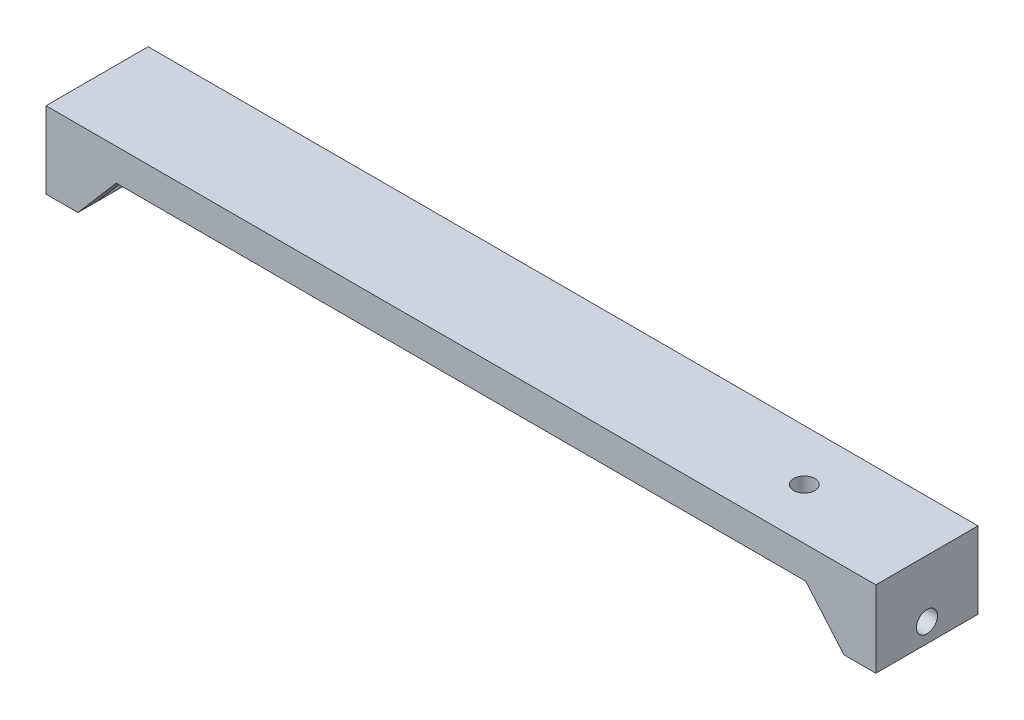
ISO-10303-21;
HEADER;
FILE_DESCRIPTION(('STEP AP214'),'2;1');
FILE_NAME('part.step','',(''),(''),'','','');
FILE_SCHEMA(('AUTOMOTIVE_DESIGN { 1 0 10303 214 1 1 1 1 }'));
ENDSEC;
DATA;
#1=APPLICATION_CONTEXT('core data for automotive mechanical design processes');
#2=APPLICATION_PROTOCOL_DEFINITION('international standard','automotive_design',2000,#1);
#3=PRODUCT_CONTEXT('',#1,'mechanical');
#4=PRODUCT('Part','Part','',(#3));
#5=PRODUCT_RELATED_PRODUCT_CATEGORY('part','',(#4));
#6=PRODUCT_DEFINITION_FORMATION('','',#4);
#7=PRODUCT_DEFINITION_CONTEXT('part definition',#1,'design');
#8=PRODUCT_DEFINITION('design','',#6,#7);
#9=PRODUCT_DEFINITION_SHAPE('','',#8);
#10=(LENGTH_UNIT() NAMED_UNIT(*) SI_UNIT(.MILLI.,.METRE.));
#11=(NAMED_UNIT(*) PLANE_ANGLE_UNIT() SI_UNIT($,.RADIAN.));
#12=(NAMED_UNIT(*) SI_UNIT($,.STERADIAN.) SOLID_ANGLE_UNIT());
#13=UNCERTAINTY_MEASURE_WITH_UNIT(LENGTH_MEASURE(1.E-05),#10,'distance_accuracy_value','');
#14=(GEOMETRIC_REPRESENTATION_CONTEXT(3) GLOBAL_UNCERTAINTY_ASSIGNED_CONTEXT((#13)) GLOBAL_UNIT_ASSIGNED_CONTEXT((#10,
#11,#12)) REPRESENTATION_CONTEXT('',''));
#15=CARTESIAN_POINT('',(0.,0.,0.));
#16=DIRECTION('',(0.,0.,1.));
#17=DIRECTION('',(1.,0.,0.));
#18=AXIS2_PLACEMENT_3D('',#15,#16,#17);
#19=CARTESIAN_POINT('',(60.,-5.00000000000001,16.));
#20=DIRECTION('',(0.,1.,0.));
#21=DIRECTION('',(0.,0.,1.));
#22=AXIS2_PLACEMENT_3D('',#19,#20,#21);
#23=PLANE('',#22);
#24=CARTESIAN_POINT('',(45.79,-5.00000000000001,8.));
#25=DIRECTION('',(0.,1.,0.));
#26=DIRECTION('',(0.,0.,1.));
#27=AXIS2_PLACEMENT_3D('',#24,#25,#26);
#28=CIRCLE('',#27,1.65);
#29=CARTESIAN_POINT('',(45.79,-5.00000000000001,9.65));
#30=VERTEX_POINT('',#29);
#31=EDGE_CURVE('E158',#30,#30,#28,.T.);
#32=ORIENTED_EDGE('',*,*,#31,.T.);
#33=EDGE_LOOP('',(#32));
#34=FACE_BOUND('',#33,.T.);
#35=DIRECTION('',(-1.,0.,0.));
#36=VECTOR('',#35,1.);
#37=CARTESIAN_POINT('',(54.,-5.00000000000001,13.));
#38=LINE('',#37,#36);
#39=CARTESIAN_POINT('',(60.,-5.00000000000001,13.));
#40=VERTEX_POINT('',#39);
#41=CARTESIAN_POINT('',(54.,-5.00000000000001,13.));
#42=VERTEX_POINT('',#41);
#43=EDGE_CURVE('E154',#40,#42,#38,.T.);
#44=ORIENTED_EDGE('',*,*,#43,.T.);
#45=DIRECTION('',(0.,0.,1.));
#46=VECTOR('',#45,1.);
#47=CARTESIAN_POINT('',(54.,-5.00000000000001,13.));
#48=LINE('',#47,#46);
#49=CARTESIAN_POINT('',(54.,-5.00000000000001,16.));
#50=VERTEX_POINT('',#49);
#51=EDGE_CURVE('E139',#42,#50,#48,.T.);
#52=ORIENTED_EDGE('',*,*,#51,.T.);
#53=DIRECTION('',(1.,0.,0.));
#54=VECTOR('',#53,1.);
#55=CARTESIAN_POINT('',(60.,-5.00000000000001,16.));
#56=LINE('',#55,#54);
#57=CARTESIAN_POINT('',(-54.,-5.00000000000001,16.));
#58=VERTEX_POINT('',#57);
#59=EDGE_CURVE('E227',#58,#50,#56,.T.);
#60=ORIENTED_EDGE('',*,*,#59,.F.);
#61=DIRECTION('',(0.,0.,1.));
#62=VECTOR('',#61,1.);
#63=CARTESIAN_POINT('',(-54.,-5.00000000000001,13.));
#64=LINE('',#63,#62);
#65=CARTESIAN_POINT('',(-54.,-5.00000000000001,13.));
#66=VERTEX_POINT('',#65);
#67=EDGE_CURVE('E187',#66,#58,#64,.T.);
#68=ORIENTED_EDGE('',*,*,#67,.F.);
#69=DIRECTION('',(1.,0.,0.));
#70=VECTOR('',#69,1.);
#71=CARTESIAN_POINT('',(-54.,-5.00000000000001,13.));
#72=LINE('',#71,#70);
#73=CARTESIAN_POINT('',(-60.,-5.00000000000001,13.));
#74=VERTEX_POINT('',#73);
#75=EDGE_CURVE('E180',#74,#66,#72,.T.);
#76=ORIENTED_EDGE('',*,*,#75,.F.);
#77=DIRECTION('',(0.,0.,-1.));
#78=VECTOR('',#77,1.);
#79=CARTESIAN_POINT('',(-60.,-5.00000000000001,16.));
#80=LINE('',#79,#78);
#81=CARTESIAN_POINT('',(-60.,-5.00000000000001,3.));
#82=VERTEX_POINT('',#81);
#83=EDGE_CURVE('E260',#74,#82,#80,.T.);
#84=ORIENTED_EDGE('',*,*,#83,.T.);
#85=DIRECTION('',(1.,0.,0.));
#86=VECTOR('',#85,1.);
#87=CARTESIAN_POINT('',(-54.,-5.00000000000001,3.));
#88=LINE('',#87,#86);
#89=CARTESIAN_POINT('',(-54.,-5.00000000000001,3.));
#90=VERTEX_POINT('',#89);
#91=EDGE_CURVE('E192',#82,#90,#88,.T.);
#92=ORIENTED_EDGE('',*,*,#91,.T.);
#93=DIRECTION('',(0.,0.,-1.));
#94=VECTOR('',#93,1.);
#95=CARTESIAN_POINT('',(-54.,-5.00000000000001,3.));
#96=LINE('',#95,#94);
#97=CARTESIAN_POINT('',(-54.,-5.,0.));
#98=VERTEX_POINT('',#97);
#99=EDGE_CURVE('E200',#90,#98,#96,.T.);
#100=ORIENTED_EDGE('',*,*,#99,.T.);
#101=DIRECTION('',(1.,0.,0.));
#102=VECTOR('',#101,1.);
#103=CARTESIAN_POINT('',(60.,-5.00000000000001,0.));
#104=LINE('',#103,#102);
#105=CARTESIAN_POINT('',(54.,-5.00000000000002,0.));
#106=VERTEX_POINT('',#105);
#107=EDGE_CURVE('E240',#98,#106,#104,.T.);
#108=ORIENTED_EDGE('',*,*,#107,.T.);
#109=DIRECTION('',(0.,0.,-1.));
#110=VECTOR('',#109,1.);
#111=CARTESIAN_POINT('',(54.,-5.00000000000001,3.));
#112=LINE('',#111,#110);
#113=CARTESIAN_POINT('',(54.,-5.00000000000001,3.));
#114=VERTEX_POINT('',#113);
#115=EDGE_CURVE('E52',#114,#106,#112,.T.);
#116=ORIENTED_EDGE('',*,*,#115,.F.);
#117=DIRECTION('',(-1.,0.,0.));
#118=VECTOR('',#117,1.);
#119=CARTESIAN_POINT('',(54.,-5.00000000000001,3.));
#120=LINE('',#119,#118);
#121=CARTESIAN_POINT('',(60.,-5.00000000000001,3.));
#122=VERTEX_POINT('',#121);
#123=EDGE_CURVE('E164',#122,#114,#120,.T.);
#124=ORIENTED_EDGE('',*,*,#123,.F.);
#125=DIRECTION('',(0.,0.,-1.));
#126=VECTOR('',#125,1.);
#127=CARTESIAN_POINT('',(60.,-5.00000000000001,16.));
#128=LINE('',#127,#126);
#129=EDGE_CURVE('E60',#40,#122,#128,.T.);
#130=ORIENTED_EDGE('',*,*,#129,.F.);
#131=EDGE_LOOP('',(#44,#52,#60,#68,#76,#84,#92,#100,#108,#116,#124,#130));
#132=FACE_BOUND('',#131,.T.);
#133=ADVANCED_FACE('F37',(#34,#132),#23,.F.);
#134=CARTESIAN_POINT('',(-65.,-12.,16.));
#135=DIRECTION('',(1.,0.,0.));
#136=DIRECTION('',(0.,0.,-1.));
#137=AXIS2_PLACEMENT_3D('',#134,#135,#136);
#138=PLANE('',#137);
#139=CARTESIAN_POINT('',(-65.,-8.99999999999993,8.));
#140=DIRECTION('',(1.,0.,0.));
#141=DIRECTION('',(0.,1.,0.));
#142=AXIS2_PLACEMENT_3D('',#139,#140,#141);
#143=CIRCLE('',#142,1.65);
#144=CARTESIAN_POINT('',(-65.,-7.34999999999993,8.));
#145=VERTEX_POINT('',#144);
#146=EDGE_CURVE('E210',#145,#145,#143,.T.);
#147=ORIENTED_EDGE('',*,*,#146,.T.);
#148=EDGE_LOOP('',(#147));
#149=FACE_BOUND('',#148,.T.);
#150=DIRECTION('',(0.,-1.,0.));
#151=VECTOR('',#150,1.);
#152=CARTESIAN_POINT('',(-65.,-12.,0.));
#153=LINE('',#152,#151);
#154=CARTESIAN_POINT('',(-65.,0.,0.));
#155=VERTEX_POINT('',#154);
#156=CARTESIAN_POINT('',(-65.,-12.,0.));
#157=VERTEX_POINT('',#156);
#158=EDGE_CURVE('E219',#155,#157,#153,.T.);
#159=ORIENTED_EDGE('',*,*,#158,.T.);
#160=DIRECTION('',(0.,0.,-1.));
#161=VECTOR('',#160,1.);
#162=CARTESIAN_POINT('',(-65.,-12.,16.));
#163=LINE('',#162,#161);
#164=CARTESIAN_POINT('',(-65.,-12.,16.));
#165=VERTEX_POINT('',#164);
#166=EDGE_CURVE('E11',#165,#157,#163,.T.);
#167=ORIENTED_EDGE('',*,*,#166,.F.);
#168=DIRECTION('',(0.,-1.,0.));
#169=VECTOR('',#168,1.);
#170=CARTESIAN_POINT('',(-65.,-12.,16.));
#171=LINE('',#170,#169);
#172=CARTESIAN_POINT('',(-65.,0.,16.));
#173=VERTEX_POINT('',#172);
#174=EDGE_CURVE('E220',#173,#165,#171,.T.);
#175=ORIENTED_EDGE('',*,*,#174,.F.);
#176=DIRECTION('',(0.,0.,-1.));
#177=VECTOR('',#176,1.);
#178=CARTESIAN_POINT('',(-65.,0.,16.));
#179=LINE('',#178,#177);
#180=EDGE_CURVE('E235',#173,#155,#179,.T.);
#181=ORIENTED_EDGE('',*,*,#180,.T.);
#182=EDGE_LOOP('',(#159,#167,#175,#181));
#183=FACE_BOUND('',#182,.T.);
#184=ADVANCED_FACE('F39',(#149,#183),#138,.F.);
#185=CARTESIAN_POINT('',(-60.,-12.,16.));
#186=DIRECTION('',(0.,1.,0.));
#187=DIRECTION('',(-1.,0.,0.));
#188=AXIS2_PLACEMENT_3D('',#185,#186,#187);
#189=PLANE('',#188);
#190=DIRECTION('',(1.,0.,0.));
#191=VECTOR('',#190,1.);
#192=CARTESIAN_POINT('',(-60.,-12.,0.));
#193=LINE('',#192,#191);
#194=CARTESIAN_POINT('',(-60.,-12.,0.));
#195=VERTEX_POINT('',#194);
#196=EDGE_CURVE('E238',#157,#195,#193,.T.);
#197=ORIENTED_EDGE('',*,*,#196,.T.);
#198=DIRECTION('',(0.,0.,-1.));
#199=VECTOR('',#198,1.);
#200=CARTESIAN_POINT('',(-60.,-12.,3.));
#201=LINE('',#200,#199);
#202=CARTESIAN_POINT('',(-60.,-12.,3.));
#203=VERTEX_POINT('',#202);
#204=EDGE_CURVE('E203',#203,#195,#201,.T.);
#205=ORIENTED_EDGE('',*,*,#204,.F.);
#206=DIRECTION('',(0.,0.,-1.));
#207=VECTOR('',#206,1.);
#208=CARTESIAN_POINT('',(-60.,-12.,16.));
#209=LINE('',#208,#207);
#210=CARTESIAN_POINT('',(-60.,-12.,13.));
#211=VERTEX_POINT('',#210);
#212=EDGE_CURVE('E261',#211,#203,#209,.T.);
#213=ORIENTED_EDGE('',*,*,#212,.F.);
#214=CARTESIAN_POINT('',(-60.,-12.,16.));
#215=VERTEX_POINT('',#214);
#216=EDGE_CURVE('E45',#215,#211,#209,.T.);
#217=ORIENTED_EDGE('',*,*,#216,.F.);
#218=DIRECTION('',(1.,0.,0.));
#219=VECTOR('',#218,1.);
#220=CARTESIAN_POINT('',(-60.,-12.,16.));
#221=LINE('',#220,#219);
#222=EDGE_CURVE('E223',#165,#215,#221,.T.);
#223=ORIENTED_EDGE('',*,*,#222,.F.);
#224=ORIENTED_EDGE('',*,*,#166,.T.);
#225=EDGE_LOOP('',(#197,#205,#213,#217,#223,#224));
#226=FACE_BOUND('',#225,.T.);
#227=ADVANCED_FACE('F274',(#226),#189,.F.);
#228=CARTESIAN_POINT('',(-60.,-5.00000000000001,16.));
#229=DIRECTION('',(-1.,0.,0.));
#230=DIRECTION('',(0.,-1.,0.));
#231=AXIS2_PLACEMENT_3D('',#228,#229,#230);
#232=PLANE('',#231);
#233=CARTESIAN_POINT('',(-60.,-8.99999999999994,8.));
#234=DIRECTION('',(-1.,0.,0.));
#235=DIRECTION('',(0.,-1.,0.));
#236=AXIS2_PLACEMENT_3D('',#233,#234,#235);
#237=CIRCLE('',#236,1.65);
#238=CARTESIAN_POINT('',(-60.,-10.6499999999999,8.));
#239=VERTEX_POINT('',#238);
#240=EDGE_CURVE('E216',#239,#239,#237,.T.);
#241=ORIENTED_EDGE('',*,*,#240,.T.);
#242=EDGE_LOOP('',(#241));
#243=FACE_BOUND('',#242,.T.);
#244=ORIENTED_EDGE('',*,*,#83,.F.);
#245=DIRECTION('',(0.,1.,0.));
#246=VECTOR('',#245,1.);
#247=CARTESIAN_POINT('',(-60.,-5.00000000000001,13.));
#248=LINE('',#247,#246);
#249=EDGE_CURVE('E183',#211,#74,#248,.T.);
#250=ORIENTED_EDGE('',*,*,#249,.F.);
#251=ORIENTED_EDGE('',*,*,#212,.T.);
#252=DIRECTION('',(0.,1.,0.));
#253=VECTOR('',#252,1.);
#254=CARTESIAN_POINT('',(-60.,-5.00000000000001,3.));
#255=LINE('',#254,#253);
#256=EDGE_CURVE('E197',#203,#82,#255,.T.);
#257=ORIENTED_EDGE('',*,*,#256,.T.);
#258=EDGE_LOOP('',(#244,#250,#251,#257));
#259=FACE_BOUND('',#258,.T.);
#260=ADVANCED_FACE('F270',(#243,#259),#232,.F.);
#261=CARTESIAN_POINT('',(60.,-12.,16.));
#262=DIRECTION('',(1.,0.,0.));
#263=DIRECTION('',(0.,1.,0.));
#264=AXIS2_PLACEMENT_3D('',#261,#262,#263);
#265=PLANE('',#264);
#266=CARTESIAN_POINT('',(60.,-9.00000000000001,8.));
#267=DIRECTION('',(1.,0.,0.));
#268=DIRECTION('',(0.,1.,0.));
#269=AXIS2_PLACEMENT_3D('',#266,#267,#268);
#270=CIRCLE('',#269,1.65);
#271=CARTESIAN_POINT('',(60.,-7.35000000000001,8.));
#272=VERTEX_POINT('',#271);
#273=EDGE_CURVE('E213',#272,#272,#270,.T.);
#274=ORIENTED_EDGE('',*,*,#273,.T.);
#275=EDGE_LOOP('',(#274));
#276=FACE_BOUND('',#275,.T.);
#277=DIRECTION('',(0.,0.,-1.));
#278=VECTOR('',#277,1.);
#279=CARTESIAN_POINT('',(60.,-12.,16.));
#280=LINE('',#279,#278);
#281=CARTESIAN_POINT('',(60.,-12.,13.));
#282=VERTEX_POINT('',#281);
#283=CARTESIAN_POINT('',(60.,-12.,3.));
#284=VERTEX_POINT('',#283);
#285=EDGE_CURVE('E255',#282,#284,#280,.T.);
#286=ORIENTED_EDGE('',*,*,#285,.F.);
#287=DIRECTION('',(0.,1.,0.));
#288=VECTOR('',#287,1.);
#289=CARTESIAN_POINT('',(60.,-5.00000000000001,13.));
#290=LINE('',#289,#288);
#291=EDGE_CURVE('E150',#282,#40,#290,.T.);
#292=ORIENTED_EDGE('',*,*,#291,.T.);
#293=ORIENTED_EDGE('',*,*,#129,.T.);
#294=DIRECTION('',(0.,1.,0.));
#295=VECTOR('',#294,1.);
#296=CARTESIAN_POINT('',(60.,-5.00000000000001,3.));
#297=LINE('',#296,#295);
#298=EDGE_CURVE('E167',#284,#122,#297,.T.);
#299=ORIENTED_EDGE('',*,*,#298,.F.);
#300=EDGE_LOOP('',(#286,#292,#293,#299));
#301=FACE_BOUND('',#300,.T.);
#302=ADVANCED_FACE('F305',(#276,#301),#265,.F.);
#303=CARTESIAN_POINT('',(65.,-12.,16.));
#304=DIRECTION('',(0.,1.,0.));
#305=DIRECTION('',(-1.,0.,0.));
#306=AXIS2_PLACEMENT_3D('',#303,#304,#305);
#307=PLANE('',#306);
#308=DIRECTION('',(1.,0.,0.));
#309=VECTOR('',#308,1.);
#310=CARTESIAN_POINT('',(65.,-12.,0.));
#311=LINE('',#310,#309);
#312=CARTESIAN_POINT('',(60.,-12.,0.));
#313=VERTEX_POINT('',#312);
#314=CARTESIAN_POINT('',(65.,-12.,0.));
#315=VERTEX_POINT('',#314);
#316=EDGE_CURVE('E242',#313,#315,#311,.T.);
#317=ORIENTED_EDGE('',*,*,#316,.T.);
#318=DIRECTION('',(0.,0.,-1.));
#319=VECTOR('',#318,1.);
#320=CARTESIAN_POINT('',(65.,-12.,16.));
#321=LINE('',#320,#319);
#322=CARTESIAN_POINT('',(65.,-12.,16.));
#323=VERTEX_POINT('',#322);
#324=EDGE_CURVE('E252',#323,#315,#321,.T.);
#325=ORIENTED_EDGE('',*,*,#324,.F.);
#326=DIRECTION('',(1.,0.,0.));
#327=VECTOR('',#326,1.);
#328=CARTESIAN_POINT('',(65.,-12.,16.));
#329=LINE('',#328,#327);
#330=CARTESIAN_POINT('',(60.,-12.,16.));
#331=VERTEX_POINT('',#330);
#332=EDGE_CURVE('E229',#331,#323,#329,.T.);
#333=ORIENTED_EDGE('',*,*,#332,.F.);
#334=EDGE_CURVE('E256',#331,#282,#280,.T.);
#335=ORIENTED_EDGE('',*,*,#334,.T.);
#336=ORIENTED_EDGE('',*,*,#285,.T.);
#337=DIRECTION('',(0.,0.,-1.));
#338=VECTOR('',#337,1.);
#339=CARTESIAN_POINT('',(60.,-12.,3.));
#340=LINE('',#339,#338);
#341=EDGE_CURVE('E173',#284,#313,#340,.T.);
#342=ORIENTED_EDGE('',*,*,#341,.T.);
#343=EDGE_LOOP('',(#317,#325,#333,#335,#336,#342));
#344=FACE_BOUND('',#343,.T.);
#345=ADVANCED_FACE('F308',(#344),#307,.F.);
#346=CARTESIAN_POINT('',(65.,0.,16.));
#347=DIRECTION('',(-1.,0.,0.));
#348=DIRECTION('',(0.,0.,1.));
#349=AXIS2_PLACEMENT_3D('',#346,#347,#348);
#350=PLANE('',#349);
#351=CARTESIAN_POINT('',(65.,-9.00000000000001,8.));
#352=DIRECTION('',(1.,0.,0.));
#353=DIRECTION('',(0.,1.,0.));
#354=AXIS2_PLACEMENT_3D('',#351,#352,#353);
#355=CIRCLE('',#354,1.65);
#356=CARTESIAN_POINT('',(65.,-7.35000000000001,8.));
#357=VERTEX_POINT('',#356);
#358=EDGE_CURVE('E206',#357,#357,#355,.T.);
#359=ORIENTED_EDGE('',*,*,#358,.F.);
#360=EDGE_LOOP('',(#359));
#361=FACE_BOUND('',#360,.T.);
#362=DIRECTION('',(0.,1.,0.));
#363=VECTOR('',#362,1.);
#364=CARTESIAN_POINT('',(65.,0.,0.));
#365=LINE('',#364,#363);
#366=CARTESIAN_POINT('',(65.,0.,0.));
#367=VERTEX_POINT('',#366);
#368=EDGE_CURVE('E244',#315,#367,#365,.T.);
#369=ORIENTED_EDGE('',*,*,#368,.T.);
#370=DIRECTION('',(0.,0.,-1.));
#371=VECTOR('',#370,1.);
#372=CARTESIAN_POINT('',(65.,0.,16.));
#373=LINE('',#372,#371);
#374=CARTESIAN_POINT('',(65.,0.,16.));
#375=VERTEX_POINT('',#374);
#376=EDGE_CURVE('E249',#375,#367,#373,.T.);
#377=ORIENTED_EDGE('',*,*,#376,.F.);
#378=DIRECTION('',(0.,1.,0.));
#379=VECTOR('',#378,1.);
#380=CARTESIAN_POINT('',(65.,0.,16.));
#381=LINE('',#380,#379);
#382=EDGE_CURVE('E231',#323,#375,#381,.T.);
#383=ORIENTED_EDGE('',*,*,#382,.F.);
#384=ORIENTED_EDGE('',*,*,#324,.T.);
#385=EDGE_LOOP('',(#369,#377,#383,#384));
#386=FACE_BOUND('',#385,.T.);
#387=ADVANCED_FACE('F314',(#361,#386),#350,.F.);
#388=CARTESIAN_POINT('',(-65.,0.,16.));
#389=DIRECTION('',(0.,-1.,0.));
#390=DIRECTION('',(0.,0.,-1.));
#391=AXIS2_PLACEMENT_3D('',#388,#389,#390);
#392=PLANE('',#391);
#393=CARTESIAN_POINT('',(45.79,0.,8.));
#394=DIRECTION('',(0.,1.,0.));
#395=DIRECTION('',(0.,0.,1.));
#396=AXIS2_PLACEMENT_3D('',#393,#394,#395);
#397=CIRCLE('',#396,1.65);
#398=CARTESIAN_POINT('',(45.79,0.,9.65));
#399=VERTEX_POINT('',#398);
#400=EDGE_CURVE('E500',#399,#399,#397,.T.);
#401=ORIENTED_EDGE('',*,*,#400,.F.);
#402=EDGE_LOOP('',(#401));
#403=FACE_BOUND('',#402,.T.);
#404=DIRECTION('',(-1.,0.,0.));
#405=VECTOR('',#404,1.);
#406=CARTESIAN_POINT('',(-65.,0.,0.));
#407=LINE('',#406,#405);
#408=EDGE_CURVE('E224',#367,#155,#407,.T.);
#409=ORIENTED_EDGE('',*,*,#408,.T.);
#410=ORIENTED_EDGE('',*,*,#180,.F.);
#411=DIRECTION('',(-1.,0.,0.));
#412=VECTOR('',#411,1.);
#413=CARTESIAN_POINT('',(-65.,0.,16.));
#414=LINE('',#413,#412);
#415=EDGE_CURVE('E233',#375,#173,#414,.T.);
#416=ORIENTED_EDGE('',*,*,#415,.F.);
#417=ORIENTED_EDGE('',*,*,#376,.T.);
#418=EDGE_LOOP('',(#409,#410,#416,#417));
#419=FACE_BOUND('',#418,.T.);
#420=ADVANCED_FACE('F316',(#403,#419),#392,.F.);
#421=CARTESIAN_POINT('',(0.,0.,16.));
#422=DIRECTION('',(0.,0.,-1.));
#423=DIRECTION('',(-1.,0.,0.));
#424=AXIS2_PLACEMENT_3D('',#421,#422,#423);
#425=PLANE('',#424);
#426=ORIENTED_EDGE('',*,*,#59,.T.);
#427=DIRECTION('',(0.65079137345597,-0.759256602365296,0.));
#428=VECTOR('',#427,1.);
#429=CARTESIAN_POINT('',(54.,-5.00000000000001,16.));
#430=LINE('',#429,#428);
#431=EDGE_CURVE('E145',#50,#331,#430,.T.);
#432=ORIENTED_EDGE('',*,*,#431,.T.);
#433=ORIENTED_EDGE('',*,*,#332,.T.);
#434=ORIENTED_EDGE('',*,*,#382,.T.);
#435=ORIENTED_EDGE('',*,*,#415,.T.);
#436=ORIENTED_EDGE('',*,*,#174,.T.);
#437=ORIENTED_EDGE('',*,*,#222,.T.);
#438=DIRECTION('',(-0.65079137345597,-0.759256602365296,0.));
#439=VECTOR('',#438,1.);
#440=CARTESIAN_POINT('',(-54.,-5.00000000000001,16.));
#441=LINE('',#440,#439);
#442=EDGE_CURVE('E177',#58,#215,#441,.T.);
#443=ORIENTED_EDGE('',*,*,#442,.F.);
#444=EDGE_LOOP('',(#426,#432,#433,#434,#435,#436,#437,#443));
#445=FACE_BOUND('',#444,.T.);
#446=ADVANCED_FACE('F289',(#445),#425,.F.);
#447=CARTESIAN_POINT('',(0.,0.,0.));
#448=DIRECTION('',(0.,0.,-1.));
#449=DIRECTION('',(-1.,0.,0.));
#450=AXIS2_PLACEMENT_3D('',#447,#448,#449);
#451=PLANE('',#450);
#452=DIRECTION('',(0.65079137345597,-0.759256602365296,0.));
#453=VECTOR('',#452,1.);
#454=CARTESIAN_POINT('',(54.,-5.00000000000001,0.));
#455=LINE('',#454,#453);
#456=EDGE_CURVE('E149',#106,#313,#455,.T.);
#457=ORIENTED_EDGE('',*,*,#456,.F.);
#458=ORIENTED_EDGE('',*,*,#107,.F.);
#459=DIRECTION('',(-0.65079137345597,-0.759256602365296,0.));
#460=VECTOR('',#459,1.);
#461=CARTESIAN_POINT('',(-54.,-5.00000000000001,0.));
#462=LINE('',#461,#460);
#463=EDGE_CURVE('E191',#98,#195,#462,.T.);
#464=ORIENTED_EDGE('',*,*,#463,.T.);
#465=ORIENTED_EDGE('',*,*,#196,.F.);
#466=ORIENTED_EDGE('',*,*,#158,.F.);
#467=ORIENTED_EDGE('',*,*,#408,.F.);
#468=ORIENTED_EDGE('',*,*,#368,.F.);
#469=ORIENTED_EDGE('',*,*,#316,.F.);
#470=EDGE_LOOP('',(#457,#458,#464,#465,#466,#467,#468,#469));
#471=FACE_BOUND('',#470,.T.);
#472=ADVANCED_FACE('F298',(#471),#451,.T.);
#473=CARTESIAN_POINT('',(-65.,-8.99999999999993,8.));
#474=DIRECTION('',(1.,0.,0.));
#475=DIRECTION('',(0.,1.,0.));
#476=AXIS2_PLACEMENT_3D('',#473,#474,#475);
#477=CYLINDRICAL_SURFACE('',#476,1.65);
#478=ORIENTED_EDGE('',*,*,#358,.T.);
#479=EDGE_LOOP('',(#478));
#480=FACE_BOUND('',#479,.T.);
#481=ORIENTED_EDGE('',*,*,#273,.F.);
#482=EDGE_LOOP('',(#481));
#483=FACE_BOUND('',#482,.T.);
#484=ADVANCED_FACE('F378',(#480,#483),#477,.F.);
#485=ORIENTED_EDGE('',*,*,#146,.F.);
#486=EDGE_LOOP('',(#485));
#487=FACE_BOUND('',#486,.T.);
#488=ORIENTED_EDGE('',*,*,#240,.F.);
#489=EDGE_LOOP('',(#488));
#490=FACE_BOUND('',#489,.T.);
#491=ADVANCED_FACE('F383',(#487,#490),#477,.F.);
#492=CARTESIAN_POINT('',(-54.,-5.00000000000001,3.));
#493=DIRECTION('',(0.759256602365296,-0.650791373455969,0.));
#494=DIRECTION('',(0.65079137345597,0.759256602365296,0.));
#495=AXIS2_PLACEMENT_3D('',#492,#493,#494);
#496=PLANE('',#495);
#497=ORIENTED_EDGE('',*,*,#463,.F.);
#498=ORIENTED_EDGE('',*,*,#99,.F.);
#499=DIRECTION('',(-0.65079137345597,-0.759256602365296,0.));
#500=VECTOR('',#499,1.);
#501=CARTESIAN_POINT('',(-54.,-5.00000000000001,3.));
#502=LINE('',#501,#500);
#503=EDGE_CURVE('E194',#90,#203,#502,.T.);
#504=ORIENTED_EDGE('',*,*,#503,.T.);
#505=ORIENTED_EDGE('',*,*,#204,.T.);
#506=EDGE_LOOP('',(#497,#498,#504,#505));
#507=FACE_BOUND('',#506,.T.);
#508=ADVANCED_FACE('F279',(#507),#496,.T.);
#509=CARTESIAN_POINT('',(0.,0.,3.));
#510=DIRECTION('',(0.,0.,1.));
#511=DIRECTION('',(1.,0.,0.));
#512=AXIS2_PLACEMENT_3D('',#509,#510,#511);
#513=PLANE('',#512);
#514=ORIENTED_EDGE('',*,*,#91,.F.);
#515=ORIENTED_EDGE('',*,*,#256,.F.);
#516=ORIENTED_EDGE('',*,*,#503,.F.);
#517=EDGE_LOOP('',(#514,#515,#516));
#518=FACE_BOUND('',#517,.T.);
#519=ADVANCED_FACE('F281',(#518),#513,.T.);
#520=CARTESIAN_POINT('',(-54.,-5.00000000000001,13.));
#521=DIRECTION('',(-0.759256602365296,0.650791373455969,0.));
#522=DIRECTION('',(-0.65079137345597,-0.759256602365296,0.));
#523=AXIS2_PLACEMENT_3D('',#520,#521,#522);
#524=PLANE('',#523);
#525=ORIENTED_EDGE('',*,*,#442,.T.);
#526=ORIENTED_EDGE('',*,*,#216,.T.);
#527=DIRECTION('',(-0.65079137345597,-0.759256602365296,0.));
#528=VECTOR('',#527,1.);
#529=CARTESIAN_POINT('',(-54.,-5.00000000000001,13.));
#530=LINE('',#529,#528);
#531=EDGE_CURVE('E185',#66,#211,#530,.T.);
#532=ORIENTED_EDGE('',*,*,#531,.F.);
#533=ORIENTED_EDGE('',*,*,#67,.T.);
#534=EDGE_LOOP('',(#525,#526,#532,#533));
#535=FACE_BOUND('',#534,.T.);
#536=ADVANCED_FACE('F287',(#535),#524,.F.);
#537=CARTESIAN_POINT('',(0.,0.,13.));
#538=DIRECTION('',(0.,0.,-1.));
#539=DIRECTION('',(1.,0.,0.));
#540=AXIS2_PLACEMENT_3D('',#537,#538,#539);
#541=PLANE('',#540);
#542=ORIENTED_EDGE('',*,*,#75,.T.);
#543=ORIENTED_EDGE('',*,*,#531,.T.);
#544=ORIENTED_EDGE('',*,*,#249,.T.);
#545=EDGE_LOOP('',(#542,#543,#544));
#546=FACE_BOUND('',#545,.T.);
#547=ADVANCED_FACE('F286',(#546),#541,.T.);
#548=CARTESIAN_POINT('',(54.,-5.00000000000001,3.));
#549=DIRECTION('',(0.759256602365296,0.650791373455969,0.));
#550=DIRECTION('',(-0.65079137345597,0.759256602365296,0.));
#551=AXIS2_PLACEMENT_3D('',#548,#549,#550);
#552=PLANE('',#551);
#553=ORIENTED_EDGE('',*,*,#456,.T.);
#554=ORIENTED_EDGE('',*,*,#341,.F.);
#555=DIRECTION('',(0.65079137345597,-0.759256602365296,0.));
#556=VECTOR('',#555,1.);
#557=CARTESIAN_POINT('',(54.,-5.00000000000001,3.));
#558=LINE('',#557,#556);
#559=EDGE_CURVE('E170',#114,#284,#558,.T.);
#560=ORIENTED_EDGE('',*,*,#559,.F.);
#561=ORIENTED_EDGE('',*,*,#115,.T.);
#562=EDGE_LOOP('',(#553,#554,#560,#561));
#563=FACE_BOUND('',#562,.T.);
#564=ADVANCED_FACE('F302',(#563),#552,.F.);
#565=CARTESIAN_POINT('',(0.,0.,3.));
#566=DIRECTION('',(0.,0.,1.));
#567=DIRECTION('',(-1.,0.,0.));
#568=AXIS2_PLACEMENT_3D('',#565,#566,#567);
#569=PLANE('',#568);
#570=ORIENTED_EDGE('',*,*,#123,.T.);
#571=ORIENTED_EDGE('',*,*,#559,.T.);
#572=ORIENTED_EDGE('',*,*,#298,.T.);
#573=EDGE_LOOP('',(#570,#571,#572));
#574=FACE_BOUND('',#573,.T.);
#575=ADVANCED_FACE('F304',(#574),#569,.T.);
#576=CARTESIAN_POINT('',(54.,-5.00000000000001,13.));
#577=DIRECTION('',(-0.759256602365296,-0.650791373455969,0.));
#578=DIRECTION('',(0.65079137345597,-0.759256602365296,0.));
#579=AXIS2_PLACEMENT_3D('',#576,#577,#578);
#580=PLANE('',#579);
#581=ORIENTED_EDGE('',*,*,#431,.F.);
#582=ORIENTED_EDGE('',*,*,#51,.F.);
#583=DIRECTION('',(0.65079137345597,-0.759256602365296,0.));
#584=VECTOR('',#583,1.);
#585=CARTESIAN_POINT('',(54.,-5.00000000000001,13.));
#586=LINE('',#585,#584);
#587=EDGE_CURVE('E143',#42,#282,#586,.T.);
#588=ORIENTED_EDGE('',*,*,#587,.T.);
#589=ORIENTED_EDGE('',*,*,#334,.F.);
#590=EDGE_LOOP('',(#581,#582,#588,#589));
#591=FACE_BOUND('',#590,.T.);
#592=ADVANCED_FACE('F141',(#591),#580,.T.);
#593=CARTESIAN_POINT('',(0.,0.,13.));
#594=DIRECTION('',(0.,0.,-1.));
#595=DIRECTION('',(-1.,0.,0.));
#596=AXIS2_PLACEMENT_3D('',#593,#594,#595);
#597=PLANE('',#596);
#598=ORIENTED_EDGE('',*,*,#43,.F.);
#599=ORIENTED_EDGE('',*,*,#291,.F.);
#600=ORIENTED_EDGE('',*,*,#587,.F.);
#601=EDGE_LOOP('',(#598,#599,#600));
#602=FACE_BOUND('',#601,.T.);
#603=ADVANCED_FACE('F153',(#602),#597,.T.);
#604=CARTESIAN_POINT('',(45.79,-10.,8.));
#605=DIRECTION('',(0.,1.,0.));
#606=DIRECTION('',(0.,0.,1.));
#607=AXIS2_PLACEMENT_3D('',#604,#605,#606);
#608=CYLINDRICAL_SURFACE('',#607,1.65);
#609=ORIENTED_EDGE('',*,*,#400,.T.);
#610=EDGE_LOOP('',(#609));
#611=FACE_BOUND('',#610,.T.);
#612=ORIENTED_EDGE('',*,*,#31,.F.);
#613=EDGE_LOOP('',(#612));
#614=FACE_BOUND('',#613,.T.);
#615=ADVANCED_FACE('F448',(#611,#614),#608,.F.);
#616=CLOSED_SHELL('',(#133,#184,#227,#260,#302,#345,#387,#420,#446,#472,#484,#491,#508,#519,
#536,#547,#564,#575,#592,#603,#615));
#617=MANIFOLD_SOLID_BREP('B2',#616);
#618=ADVANCED_BREP_SHAPE_REPRESENTATION('',(#18,#617),#14);
#619=SHAPE_DEFINITION_REPRESENTATION(#9,#618);
ENDSEC;
END-ISO-10303-21;
